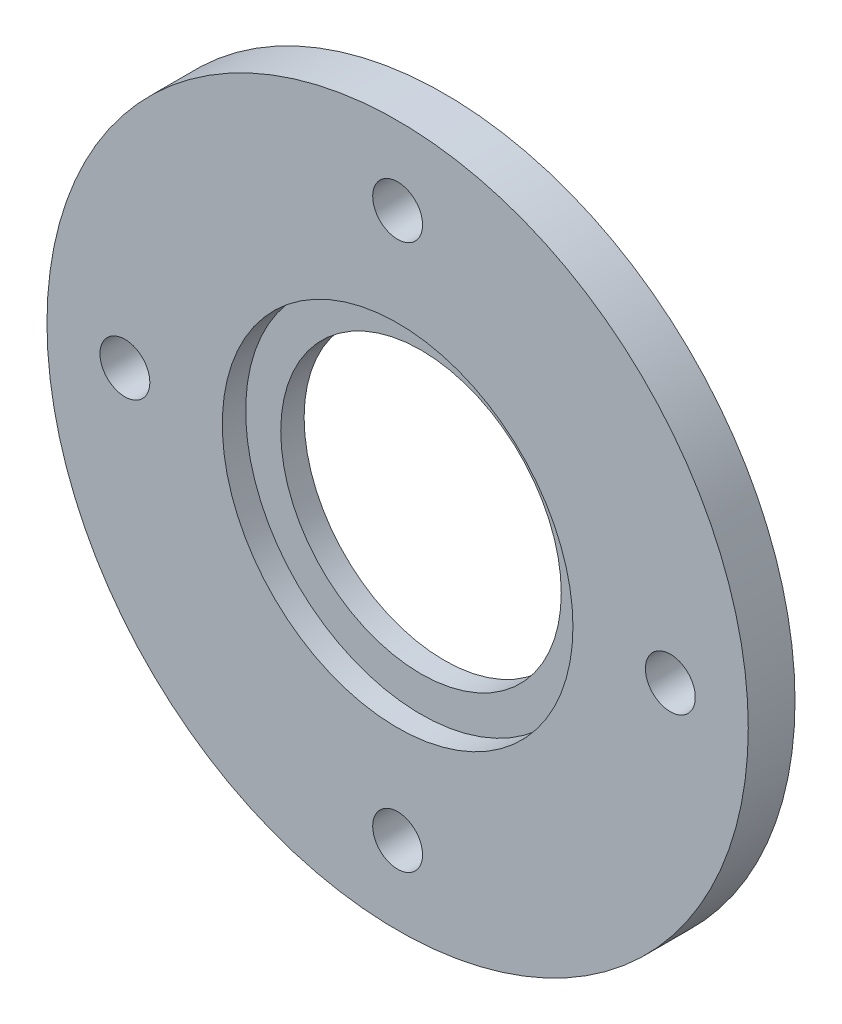
ISO-10303-21;
HEADER;
FILE_DESCRIPTION(('STEP AP214'),'2;1');
FILE_NAME('part.step','',(''),(''),'','','');
FILE_SCHEMA(('AUTOMOTIVE_DESIGN { 1 0 10303 214 1 1 1 1 }'));
ENDSEC;
DATA;
#1=APPLICATION_CONTEXT('core data for automotive mechanical design processes');
#2=APPLICATION_PROTOCOL_DEFINITION('international standard','automotive_design',2000,#1);
#3=PRODUCT_CONTEXT('',#1,'mechanical');
#4=PRODUCT('Part','Part','',(#3));
#5=PRODUCT_RELATED_PRODUCT_CATEGORY('part','',(#4));
#6=PRODUCT_DEFINITION_FORMATION('','',#4);
#7=PRODUCT_DEFINITION_CONTEXT('part definition',#1,'design');
#8=PRODUCT_DEFINITION('design','',#6,#7);
#9=PRODUCT_DEFINITION_SHAPE('','',#8);
#10=(LENGTH_UNIT() NAMED_UNIT(*) SI_UNIT(.MILLI.,.METRE.));
#11=(NAMED_UNIT(*) PLANE_ANGLE_UNIT() SI_UNIT($,.RADIAN.));
#12=(NAMED_UNIT(*) SI_UNIT($,.STERADIAN.) SOLID_ANGLE_UNIT());
#13=UNCERTAINTY_MEASURE_WITH_UNIT(LENGTH_MEASURE(1.E-05),#10,'distance_accuracy_value','');
#14=(GEOMETRIC_REPRESENTATION_CONTEXT(3) GLOBAL_UNCERTAINTY_ASSIGNED_CONTEXT((#13)) GLOBAL_UNIT_ASSIGNED_CONTEXT((#10,
#11,#12)) REPRESENTATION_CONTEXT('',''));
#15=CARTESIAN_POINT('',(0.,0.,0.));
#16=DIRECTION('',(0.,0.,1.));
#17=DIRECTION('',(1.,0.,0.));
#18=AXIS2_PLACEMENT_3D('',#15,#16,#17);
#19=CARTESIAN_POINT('',(0.,0.,3.));
#20=DIRECTION('',(0.,0.,-1.));
#21=DIRECTION('',(-1.,0.,0.));
#22=AXIS2_PLACEMENT_3D('',#19,#20,#21);
#23=CYLINDRICAL_SURFACE('',#22,9.);
#24=CARTESIAN_POINT('',(0.,0.,0.));
#25=DIRECTION('',(0.,0.,1.));
#26=DIRECTION('',(1.,0.,0.));
#27=AXIS2_PLACEMENT_3D('',#24,#25,#26);
#28=CIRCLE('',#27,9.);
#29=CARTESIAN_POINT('',(9.,0.,0.));
#30=VERTEX_POINT('',#29);
#31=EDGE_CURVE('E50',#30,#30,#28,.T.);
#32=ORIENTED_EDGE('',*,*,#31,.F.);
#33=EDGE_LOOP('',(#32));
#34=FACE_BOUND('',#33,.T.);
#35=CARTESIAN_POINT('',(0.,0.,1.5));
#36=DIRECTION('',(0.,0.,1.));
#37=DIRECTION('',(1.,0.,0.));
#38=AXIS2_PLACEMENT_3D('',#35,#36,#37);
#39=CIRCLE('',#38,9.);
#40=CARTESIAN_POINT('',(9.,0.,1.5));
#41=VERTEX_POINT('',#40);
#42=EDGE_CURVE('E82',#41,#41,#39,.T.);
#43=ORIENTED_EDGE('',*,*,#42,.T.);
#44=EDGE_LOOP('',(#43));
#45=FACE_BOUND('',#44,.T.);
#46=ADVANCED_FACE('F39',(#34,#45),#23,.F.);
#47=CARTESIAN_POINT('',(0.,0.,3.));
#48=DIRECTION('',(0.,0.,1.));
#49=DIRECTION('',(1.,0.,0.));
#50=AXIS2_PLACEMENT_3D('',#47,#48,#49);
#51=PLANE('',#50);
#52=CARTESIAN_POINT('',(0.,0.,3.));
#53=DIRECTION('',(0.,0.,1.));
#54=DIRECTION('',(1.,0.,0.));
#55=AXIS2_PLACEMENT_3D('',#52,#53,#54);
#56=CIRCLE('',#55,11.25);
#57=CARTESIAN_POINT('',(11.25,0.,3.));
#58=VERTEX_POINT('',#57);
#59=EDGE_CURVE('E79',#58,#58,#56,.T.);
#60=ORIENTED_EDGE('',*,*,#59,.F.);
#61=EDGE_LOOP('',(#60));
#62=FACE_BOUND('',#61,.T.);
#63=CARTESIAN_POINT('',(0.,17.5,3.));
#64=DIRECTION('',(0.,0.,1.));
#65=DIRECTION('',(0.,-1.,0.));
#66=AXIS2_PLACEMENT_3D('',#63,#64,#65);
#67=CIRCLE('',#66,1.6);
#68=CARTESIAN_POINT('',(0.,15.9,3.));
#69=VERTEX_POINT('',#68);
#70=EDGE_CURVE('E74',#69,#69,#67,.T.);
#71=ORIENTED_EDGE('',*,*,#70,.F.);
#72=EDGE_LOOP('',(#71));
#73=FACE_BOUND('',#72,.T.);
#74=CARTESIAN_POINT('',(17.5,0.,3.));
#75=DIRECTION('',(0.,0.,1.));
#76=DIRECTION('',(-1.,0.,0.));
#77=AXIS2_PLACEMENT_3D('',#74,#75,#76);
#78=CIRCLE('',#77,1.6);
#79=CARTESIAN_POINT('',(15.9,0.,3.));
#80=VERTEX_POINT('',#79);
#81=EDGE_CURVE('E68',#80,#80,#78,.T.);
#82=ORIENTED_EDGE('',*,*,#81,.F.);
#83=EDGE_LOOP('',(#82));
#84=FACE_BOUND('',#83,.T.);
#85=CARTESIAN_POINT('',(-1.83302770289265E-13,-17.5,3.));
#86=DIRECTION('',(0.,0.,1.));
#87=DIRECTION('',(0.,1.,0.));
#88=AXIS2_PLACEMENT_3D('',#85,#86,#87);
#89=CIRCLE('',#88,1.6);
#90=CARTESIAN_POINT('',(-1.66543659862817E-13,-15.9,3.));
#91=VERTEX_POINT('',#90);
#92=EDGE_CURVE('E61',#91,#91,#89,.T.);
#93=ORIENTED_EDGE('',*,*,#92,.F.);
#94=EDGE_LOOP('',(#93));
#95=FACE_BOUND('',#94,.T.);
#96=CARTESIAN_POINT('',(-17.5,0.,3.));
#97=DIRECTION('',(0.,0.,1.));
#98=DIRECTION('',(1.,0.,0.));
#99=AXIS2_PLACEMENT_3D('',#96,#97,#98);
#100=CIRCLE('',#99,1.6);
#101=CARTESIAN_POINT('',(-15.9,0.,3.));
#102=VERTEX_POINT('',#101);
#103=EDGE_CURVE('E55',#102,#102,#100,.T.);
#104=ORIENTED_EDGE('',*,*,#103,.F.);
#105=EDGE_LOOP('',(#104));
#106=FACE_BOUND('',#105,.T.);
#107=CARTESIAN_POINT('',(0.,0.,3.));
#108=DIRECTION('',(0.,0.,1.));
#109=DIRECTION('',(1.,0.,0.));
#110=AXIS2_PLACEMENT_3D('',#107,#108,#109);
#111=CIRCLE('',#110,22.5);
#112=CARTESIAN_POINT('',(22.5,0.,3.));
#113=VERTEX_POINT('',#112);
#114=EDGE_CURVE('E10',#113,#113,#111,.T.);
#115=ORIENTED_EDGE('',*,*,#114,.T.);
#116=EDGE_LOOP('',(#115));
#117=FACE_BOUND('',#116,.T.);
#118=ADVANCED_FACE('F102',(#62,#73,#84,#95,#106,#117),#51,.T.);
#119=CARTESIAN_POINT('',(0.,0.,0.));
#120=DIRECTION('',(0.,0.,1.));
#121=DIRECTION('',(1.,0.,0.));
#122=AXIS2_PLACEMENT_3D('',#119,#120,#121);
#123=PLANE('',#122);
#124=CARTESIAN_POINT('',(0.,17.5,0.));
#125=DIRECTION('',(0.,0.,1.));
#126=DIRECTION('',(0.,-1.,0.));
#127=AXIS2_PLACEMENT_3D('',#124,#125,#126);
#128=CIRCLE('',#127,1.6);
#129=CARTESIAN_POINT('',(0.,15.9,0.));
#130=VERTEX_POINT('',#129);
#131=EDGE_CURVE('E58',#130,#130,#128,.T.);
#132=ORIENTED_EDGE('',*,*,#131,.T.);
#133=EDGE_LOOP('',(#132));
#134=FACE_BOUND('',#133,.T.);
#135=CARTESIAN_POINT('',(17.5,0.,0.));
#136=DIRECTION('',(0.,0.,1.));
#137=DIRECTION('',(-1.,0.,0.));
#138=AXIS2_PLACEMENT_3D('',#135,#136,#137);
#139=CIRCLE('',#138,1.6);
#140=CARTESIAN_POINT('',(15.9,0.,0.));
#141=VERTEX_POINT('',#140);
#142=EDGE_CURVE('E71',#141,#141,#139,.T.);
#143=ORIENTED_EDGE('',*,*,#142,.T.);
#144=EDGE_LOOP('',(#143));
#145=FACE_BOUND('',#144,.T.);
#146=CARTESIAN_POINT('',(-1.83302770289265E-13,-17.5,0.));
#147=DIRECTION('',(0.,0.,1.));
#148=DIRECTION('',(0.,1.,0.));
#149=AXIS2_PLACEMENT_3D('',#146,#147,#148);
#150=CIRCLE('',#149,1.6);
#151=CARTESIAN_POINT('',(-1.66543659862817E-13,-15.9,0.));
#152=VERTEX_POINT('',#151);
#153=EDGE_CURVE('E64',#152,#152,#150,.T.);
#154=ORIENTED_EDGE('',*,*,#153,.T.);
#155=EDGE_LOOP('',(#154));
#156=FACE_BOUND('',#155,.T.);
#157=CARTESIAN_POINT('',(-17.5,0.,0.));
#158=DIRECTION('',(0.,0.,1.));
#159=DIRECTION('',(1.,0.,0.));
#160=AXIS2_PLACEMENT_3D('',#157,#158,#159);
#161=CIRCLE('',#160,1.6);
#162=CARTESIAN_POINT('',(-15.9,0.,0.));
#163=VERTEX_POINT('',#162);
#164=EDGE_CURVE('E54',#163,#163,#161,.T.);
#165=ORIENTED_EDGE('',*,*,#164,.T.);
#166=EDGE_LOOP('',(#165));
#167=FACE_BOUND('',#166,.T.);
#168=CARTESIAN_POINT('',(0.,0.,0.));
#169=DIRECTION('',(0.,0.,1.));
#170=DIRECTION('',(1.,0.,0.));
#171=AXIS2_PLACEMENT_3D('',#168,#169,#170);
#172=CIRCLE('',#171,22.5);
#173=CARTESIAN_POINT('',(22.5,0.,0.));
#174=VERTEX_POINT('',#173);
#175=EDGE_CURVE('E43',#174,#174,#172,.T.);
#176=ORIENTED_EDGE('',*,*,#175,.F.);
#177=EDGE_LOOP('',(#176));
#178=FACE_BOUND('',#177,.T.);
#179=ORIENTED_EDGE('',*,*,#31,.T.);
#180=EDGE_LOOP('',(#179));
#181=FACE_BOUND('',#180,.T.);
#182=ADVANCED_FACE('F105',(#134,#145,#156,#167,#178,#181),#123,.F.);
#183=CARTESIAN_POINT('',(0.,0.,3.));
#184=DIRECTION('',(0.,0.,-1.));
#185=DIRECTION('',(-1.,0.,0.));
#186=AXIS2_PLACEMENT_3D('',#183,#184,#185);
#187=CYLINDRICAL_SURFACE('',#186,22.5);
#188=ORIENTED_EDGE('',*,*,#114,.F.);
#189=EDGE_LOOP('',(#188));
#190=FACE_BOUND('',#189,.T.);
#191=ORIENTED_EDGE('',*,*,#175,.T.);
#192=EDGE_LOOP('',(#191));
#193=FACE_BOUND('',#192,.T.);
#194=ADVANCED_FACE('F41',(#190,#193),#187,.T.);
#195=CARTESIAN_POINT('',(-17.5,0.,0.));
#196=DIRECTION('',(0.,0.,1.));
#197=DIRECTION('',(1.,0.,0.));
#198=AXIS2_PLACEMENT_3D('',#195,#196,#197);
#199=CYLINDRICAL_SURFACE('',#198,1.6);
#200=ORIENTED_EDGE('',*,*,#164,.F.);
#201=EDGE_LOOP('',(#200));
#202=FACE_BOUND('',#201,.T.);
#203=ORIENTED_EDGE('',*,*,#103,.T.);
#204=EDGE_LOOP('',(#203));
#205=FACE_BOUND('',#204,.T.);
#206=ADVANCED_FACE('F115',(#202,#205),#199,.F.);
#207=CARTESIAN_POINT('',(-1.83302770289265E-13,-17.5,0.));
#208=DIRECTION('',(0.,0.,1.));
#209=DIRECTION('',(1.,0.,0.));
#210=AXIS2_PLACEMENT_3D('',#207,#208,#209);
#211=CYLINDRICAL_SURFACE('',#210,1.6);
#212=ORIENTED_EDGE('',*,*,#153,.F.);
#213=EDGE_LOOP('',(#212));
#214=FACE_BOUND('',#213,.T.);
#215=ORIENTED_EDGE('',*,*,#92,.T.);
#216=EDGE_LOOP('',(#215));
#217=FACE_BOUND('',#216,.T.);
#218=ADVANCED_FACE('F117',(#214,#217),#211,.F.);
#219=CARTESIAN_POINT('',(17.5,0.,0.));
#220=DIRECTION('',(0.,0.,1.));
#221=DIRECTION('',(1.,0.,0.));
#222=AXIS2_PLACEMENT_3D('',#219,#220,#221);
#223=CYLINDRICAL_SURFACE('',#222,1.6);
#224=ORIENTED_EDGE('',*,*,#142,.F.);
#225=EDGE_LOOP('',(#224));
#226=FACE_BOUND('',#225,.T.);
#227=ORIENTED_EDGE('',*,*,#81,.T.);
#228=EDGE_LOOP('',(#227));
#229=FACE_BOUND('',#228,.T.);
#230=ADVANCED_FACE('F125',(#226,#229),#223,.F.);
#231=CARTESIAN_POINT('',(0.,17.5,0.));
#232=DIRECTION('',(0.,0.,1.));
#233=DIRECTION('',(1.,0.,0.));
#234=AXIS2_PLACEMENT_3D('',#231,#232,#233);
#235=CYLINDRICAL_SURFACE('',#234,1.6);
#236=ORIENTED_EDGE('',*,*,#131,.F.);
#237=EDGE_LOOP('',(#236));
#238=FACE_BOUND('',#237,.T.);
#239=ORIENTED_EDGE('',*,*,#70,.T.);
#240=EDGE_LOOP('',(#239));
#241=FACE_BOUND('',#240,.T.);
#242=ADVANCED_FACE('F98',(#238,#241),#235,.F.);
#243=CARTESIAN_POINT('',(0.,0.,1.5));
#244=DIRECTION('',(0.,0.,1.));
#245=DIRECTION('',(1.,0.,0.));
#246=AXIS2_PLACEMENT_3D('',#243,#244,#245);
#247=CYLINDRICAL_SURFACE('',#246,11.25);
#248=CARTESIAN_POINT('',(0.,0.,1.5));
#249=DIRECTION('',(0.,0.,1.));
#250=DIRECTION('',(1.,0.,0.));
#251=AXIS2_PLACEMENT_3D('',#248,#249,#250);
#252=CIRCLE('',#251,11.25);
#253=CARTESIAN_POINT('',(11.25,0.,1.5));
#254=VERTEX_POINT('',#253);
#255=EDGE_CURVE('E65',#254,#254,#252,.T.);
#256=ORIENTED_EDGE('',*,*,#255,.F.);
#257=EDGE_LOOP('',(#256));
#258=FACE_BOUND('',#257,.T.);
#259=ORIENTED_EDGE('',*,*,#59,.T.);
#260=EDGE_LOOP('',(#259));
#261=FACE_BOUND('',#260,.T.);
#262=ADVANCED_FACE('F92',(#258,#261),#247,.F.);
#263=CARTESIAN_POINT('',(0.,0.,1.5));
#264=DIRECTION('',(0.,0.,1.));
#265=DIRECTION('',(1.,0.,0.));
#266=AXIS2_PLACEMENT_3D('',#263,#264,#265);
#267=PLANE('',#266);
#268=ORIENTED_EDGE('',*,*,#42,.F.);
#269=EDGE_LOOP('',(#268));
#270=FACE_BOUND('',#269,.T.);
#271=ORIENTED_EDGE('',*,*,#255,.T.);
#272=EDGE_LOOP('',(#271));
#273=FACE_BOUND('',#272,.T.);
#274=ADVANCED_FACE('F89',(#270,#273),#267,.T.);
#275=CLOSED_SHELL('',(#46,#118,#182,#194,#206,#218,#230,#242,#262,#274));
#276=MANIFOLD_SOLID_BREP('B2',#275);
#277=ADVANCED_BREP_SHAPE_REPRESENTATION('',(#18,#276),#14);
#278=SHAPE_DEFINITION_REPRESENTATION(#9,#277);
ENDSEC;
END-ISO-10303-21;
